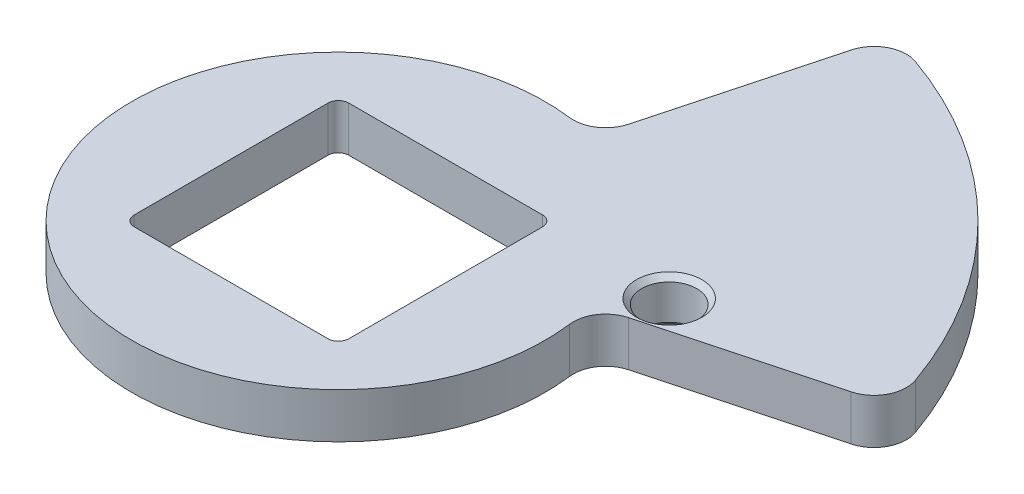
ISO-10303-21;
HEADER;
FILE_DESCRIPTION(('STEP AP214'),'2;1');
FILE_NAME('part.step','',(''),(''),'','','');
FILE_SCHEMA(('AUTOMOTIVE_DESIGN { 1 0 10303 214 1 1 1 1 }'));
ENDSEC;
DATA;
#1=APPLICATION_CONTEXT('core data for automotive mechanical design processes');
#2=APPLICATION_PROTOCOL_DEFINITION('international standard','automotive_design',2000,#1);
#3=PRODUCT_CONTEXT('',#1,'mechanical');
#4=PRODUCT('Part','Part','',(#3));
#5=PRODUCT_RELATED_PRODUCT_CATEGORY('part','',(#4));
#6=PRODUCT_DEFINITION_FORMATION('','',#4);
#7=PRODUCT_DEFINITION_CONTEXT('part definition',#1,'design');
#8=PRODUCT_DEFINITION('design','',#6,#7);
#9=PRODUCT_DEFINITION_SHAPE('','',#8);
#10=(LENGTH_UNIT() NAMED_UNIT(*) SI_UNIT(.MILLI.,.METRE.));
#11=(NAMED_UNIT(*) PLANE_ANGLE_UNIT() SI_UNIT($,.RADIAN.));
#12=(NAMED_UNIT(*) SI_UNIT($,.STERADIAN.) SOLID_ANGLE_UNIT());
#13=UNCERTAINTY_MEASURE_WITH_UNIT(LENGTH_MEASURE(1.E-05),#10,'distance_accuracy_value','');
#14=(GEOMETRIC_REPRESENTATION_CONTEXT(3) GLOBAL_UNCERTAINTY_ASSIGNED_CONTEXT((#13)) GLOBAL_UNIT_ASSIGNED_CONTEXT((#10,
#11,#12)) REPRESENTATION_CONTEXT('',''));
#15=CARTESIAN_POINT('',(0.,0.,0.));
#16=DIRECTION('',(0.,0.,1.));
#17=DIRECTION('',(1.,0.,0.));
#18=AXIS2_PLACEMENT_3D('',#15,#16,#17);
#19=CARTESIAN_POINT('',(0.,4.445,0.));
#20=DIRECTION('',(0.,-1.,0.));
#21=DIRECTION('',(0.,0.,-1.));
#22=AXIS2_PLACEMENT_3D('',#19,#20,#21);
#23=PLANE('',#22);
#24=CARTESIAN_POINT('',(22.86,4.445,-9.652));
#25=DIRECTION('',(0.,-1.,0.));
#26=DIRECTION('',(0.,0.,-1.));
#27=AXIS2_PLACEMENT_3D('',#24,#25,#26);
#28=CIRCLE('',#27,3.2147682252659);
#29=CARTESIAN_POINT('',(22.86,4.445,-12.8667682252659));
#30=VERTEX_POINT('',#29);
#31=EDGE_CURVE('E11',#30,#30,#28,.T.);
#32=ORIENTED_EDGE('',*,*,#31,.T.);
#33=EDGE_LOOP('',(#32));
#34=FACE_BOUND('',#33,.T.);
#35=CARTESIAN_POINT('',(0.,4.445,0.));
#36=DIRECTION('',(0.,1.,0.));
#37=DIRECTION('',(0.,0.,-1.));
#38=AXIS2_PLACEMENT_3D('',#35,#36,#37);
#39=CIRCLE('',#38,44.45);
#40=CARTESIAN_POINT('',(41.9232246474188,4.445,-14.773142359094));
#41=VERTEX_POINT('',#40);
#42=CARTESIAN_POINT('',(14.7731423590938,4.445,-41.9232246474188));
#43=VERTEX_POINT('',#42);
#44=EDGE_CURVE('E179',#41,#43,#39,.T.);
#45=ORIENTED_EDGE('',*,*,#44,.T.);
#46=CARTESIAN_POINT('',(13.7179179048728,4.445,-38.9287086011746));
#47=DIRECTION('',(0.,-1.,0.));
#48=DIRECTION('',(0.,0.,-1.));
#49=AXIS2_PLACEMENT_3D('',#46,#47,#48);
#50=CIRCLE('',#49,3.175);
#51=CARTESIAN_POINT('',(10.651103406405,4.445,-39.7504590693751));
#52=VERTEX_POINT('',#51);
#53=EDGE_CURVE('E201',#43,#52,#50,.F.);
#54=ORIENTED_EDGE('',*,*,#53,.T.);
#55=DIRECTION('',(-0.258819045102511,0.,0.965925826289071));
#56=VECTOR('',#55,1.);
#57=CARTESIAN_POINT('',(11.5045065548066,4.445,-42.9354029785492));
#58=LINE('',#57,#56);
#59=CARTESIAN_POINT('',(6.02517395663052,4.445,-22.4862553305868));
#60=VERTEX_POINT('',#59);
#61=EDGE_CURVE('E284',#52,#60,#58,.T.);
#62=ORIENTED_EDGE('',*,*,#61,.T.);
#63=CARTESIAN_POINT('',(2.95835945816272,4.445,-23.3080057987872));
#64=DIRECTION('',(0.,-1.,0.));
#65=DIRECTION('',(0.,0.,-1.));
#66=AXIS2_PLACEMENT_3D('',#63,#64,#65);
#67=CIRCLE('',#66,3.175);
#68=CARTESIAN_POINT('',(2.55858115300559,4.445,-20.1582752854376));
#69=VERTEX_POINT('',#68);
#70=EDGE_CURVE('E158',#60,#69,#67,.T.);
#71=ORIENTED_EDGE('',*,*,#70,.T.);
#72=CARTESIAN_POINT('',(0.,4.445,0.));
#73=DIRECTION('',(0.,1.,0.));
#74=DIRECTION('',(0.,0.,1.));
#75=AXIS2_PLACEMENT_3D('',#72,#73,#74);
#76=CIRCLE('',#75,20.32);
#77=CARTESIAN_POINT('',(20.1582752854376,4.445,-2.55858115300567));
#78=VERTEX_POINT('',#77);
#79=EDGE_CURVE('E168',#69,#78,#76,.T.);
#80=ORIENTED_EDGE('',*,*,#79,.T.);
#81=CARTESIAN_POINT('',(23.3080057987872,4.445,-2.95835945816281));
#82=DIRECTION('',(0.,-1.,0.));
#83=DIRECTION('',(0.,0.,-1.));
#84=AXIS2_PLACEMENT_3D('',#81,#82,#83);
#85=CIRCLE('',#84,3.175);
#86=CARTESIAN_POINT('',(22.4862553305867,4.445,-6.02517395663061));
#87=VERTEX_POINT('',#86);
#88=EDGE_CURVE('E209',#78,#87,#85,.T.);
#89=ORIENTED_EDGE('',*,*,#88,.T.);
#90=DIRECTION('',(0.96592582628907,0.,-0.258819045102515));
#91=VECTOR('',#90,1.);
#92=CARTESIAN_POINT('',(42.9354029785491,4.445,-11.5045065548068));
#93=LINE('',#92,#91);
#94=CARTESIAN_POINT('',(39.7504590693751,4.445,-10.6511034064052));
#95=VERTEX_POINT('',#94);
#96=EDGE_CURVE('E185',#87,#95,#93,.T.);
#97=ORIENTED_EDGE('',*,*,#96,.T.);
#98=CARTESIAN_POINT('',(38.9287086011746,4.445,-13.717917904873));
#99=DIRECTION('',(0.,-1.,0.));
#100=DIRECTION('',(0.,0.,-1.));
#101=AXIS2_PLACEMENT_3D('',#98,#99,#100);
#102=CIRCLE('',#101,3.175);
#103=EDGE_CURVE('E199',#95,#41,#102,.F.);
#104=ORIENTED_EDGE('',*,*,#103,.T.);
#105=EDGE_LOOP('',(#45,#54,#62,#71,#80,#89,#97,#104));
#106=FACE_BOUND('',#105,.T.);
#107=DIRECTION('',(0.,0.,-1.));
#108=VECTOR('',#107,1.);
#109=CARTESIAN_POINT('',(10.541,4.445,-10.541));
#110=LINE('',#109,#108);
#111=CARTESIAN_POINT('',(10.541,4.445,9.525));
#112=VERTEX_POINT('',#111);
#113=CARTESIAN_POINT('',(10.541,4.445,-9.525));
#114=VERTEX_POINT('',#113);
#115=EDGE_CURVE('E276',#112,#114,#110,.T.);
#116=ORIENTED_EDGE('',*,*,#115,.F.);
#117=CARTESIAN_POINT('',(9.525,4.445,9.525));
#118=DIRECTION('',(0.,-1.,0.));
#119=DIRECTION('',(0.,0.,-1.));
#120=AXIS2_PLACEMENT_3D('',#117,#118,#119);
#121=CIRCLE('',#120,1.016);
#122=CARTESIAN_POINT('',(9.525,4.445,10.541));
#123=VERTEX_POINT('',#122);
#124=EDGE_CURVE('E48',#112,#123,#121,.T.);
#125=ORIENTED_EDGE('',*,*,#124,.T.);
#126=DIRECTION('',(1.,0.,0.));
#127=VECTOR('',#126,1.);
#128=CARTESIAN_POINT('',(-10.541,4.445,10.541));
#129=LINE('',#128,#127);
#130=CARTESIAN_POINT('',(-9.525,4.445,10.541));
#131=VERTEX_POINT('',#130);
#132=EDGE_CURVE('E290',#131,#123,#129,.T.);
#133=ORIENTED_EDGE('',*,*,#132,.F.);
#134=CARTESIAN_POINT('',(-9.525,4.445,9.525));
#135=DIRECTION('',(0.,-1.,0.));
#136=DIRECTION('',(0.,0.,-1.));
#137=AXIS2_PLACEMENT_3D('',#134,#135,#136);
#138=CIRCLE('',#137,1.016);
#139=CARTESIAN_POINT('',(-10.541,4.445,9.525));
#140=VERTEX_POINT('',#139);
#141=EDGE_CURVE('E243',#131,#140,#138,.T.);
#142=ORIENTED_EDGE('',*,*,#141,.T.);
#143=DIRECTION('',(0.,0.,1.));
#144=VECTOR('',#143,1.);
#145=CARTESIAN_POINT('',(-10.541,4.445,-10.541));
#146=LINE('',#145,#144);
#147=CARTESIAN_POINT('',(-10.541,4.445,-9.525));
#148=VERTEX_POINT('',#147);
#149=EDGE_CURVE('E294',#148,#140,#146,.T.);
#150=ORIENTED_EDGE('',*,*,#149,.F.);
#151=CARTESIAN_POINT('',(-9.525,4.445,-9.525));
#152=DIRECTION('',(0.,-1.,0.));
#153=DIRECTION('',(0.,0.,-1.));
#154=AXIS2_PLACEMENT_3D('',#151,#152,#153);
#155=CIRCLE('',#154,1.016);
#156=CARTESIAN_POINT('',(-9.525,4.445,-10.541));
#157=VERTEX_POINT('',#156);
#158=EDGE_CURVE('E236',#148,#157,#155,.T.);
#159=ORIENTED_EDGE('',*,*,#158,.T.);
#160=DIRECTION('',(-1.,0.,0.));
#161=VECTOR('',#160,1.);
#162=CARTESIAN_POINT('',(-10.541,4.445,-10.541));
#163=LINE('',#162,#161);
#164=CARTESIAN_POINT('',(9.525,4.445,-10.541));
#165=VERTEX_POINT('',#164);
#166=EDGE_CURVE('E298',#165,#157,#163,.T.);
#167=ORIENTED_EDGE('',*,*,#166,.F.);
#168=CARTESIAN_POINT('',(9.525,4.445,-9.525));
#169=DIRECTION('',(0.,-1.,0.));
#170=DIRECTION('',(0.,0.,-1.));
#171=AXIS2_PLACEMENT_3D('',#168,#169,#170);
#172=CIRCLE('',#171,1.016);
#173=EDGE_CURVE('E232',#165,#114,#172,.T.);
#174=ORIENTED_EDGE('',*,*,#173,.T.);
#175=EDGE_LOOP('',(#116,#125,#133,#142,#150,#159,#167,#174));
#176=FACE_BOUND('',#175,.T.);
#177=ADVANCED_FACE('F33',(#34,#106,#176),#23,.F.);
#178=CARTESIAN_POINT('',(0.,0.,0.));
#179=DIRECTION('',(0.,-1.,0.));
#180=DIRECTION('',(0.,0.,-1.));
#181=AXIS2_PLACEMENT_3D('',#178,#179,#180);
#182=PLANE('',#181);
#183=CARTESIAN_POINT('',(22.86,0.,-9.652));
#184=DIRECTION('',(0.,-1.,0.));
#185=DIRECTION('',(0.,0.,-1.));
#186=AXIS2_PLACEMENT_3D('',#183,#184,#185);
#187=CIRCLE('',#186,3.2147682252659);
#188=CARTESIAN_POINT('',(22.86,0.,-12.8667682252659));
#189=VERTEX_POINT('',#188);
#190=EDGE_CURVE('E245',#189,#189,#187,.F.);
#191=ORIENTED_EDGE('',*,*,#190,.T.);
#192=EDGE_LOOP('',(#191));
#193=FACE_BOUND('',#192,.T.);
#194=DIRECTION('',(0.,0.,1.));
#195=VECTOR('',#194,1.);
#196=CARTESIAN_POINT('',(-10.541,0.,-10.541));
#197=LINE('',#196,#195);
#198=CARTESIAN_POINT('',(-10.541,0.,-9.525));
#199=VERTEX_POINT('',#198);
#200=CARTESIAN_POINT('',(-10.541,0.,9.525));
#201=VERTEX_POINT('',#200);
#202=EDGE_CURVE('E268',#199,#201,#197,.T.);
#203=ORIENTED_EDGE('',*,*,#202,.T.);
#204=CARTESIAN_POINT('',(-9.525,0.,9.525));
#205=DIRECTION('',(0.,-1.,0.));
#206=DIRECTION('',(0.,0.,-1.));
#207=AXIS2_PLACEMENT_3D('',#204,#205,#206);
#208=CIRCLE('',#207,1.016);
#209=CARTESIAN_POINT('',(-9.525,0.,10.541));
#210=VERTEX_POINT('',#209);
#211=EDGE_CURVE('E241',#201,#210,#208,.F.);
#212=ORIENTED_EDGE('',*,*,#211,.T.);
#213=DIRECTION('',(1.,0.,0.));
#214=VECTOR('',#213,1.);
#215=CARTESIAN_POINT('',(-10.541,0.,10.541));
#216=LINE('',#215,#214);
#217=CARTESIAN_POINT('',(9.525,0.,10.541));
#218=VERTEX_POINT('',#217);
#219=EDGE_CURVE('E273',#210,#218,#216,.T.);
#220=ORIENTED_EDGE('',*,*,#219,.T.);
#221=CARTESIAN_POINT('',(9.525,0.,9.525));
#222=DIRECTION('',(0.,-1.,0.));
#223=DIRECTION('',(0.,0.,-1.));
#224=AXIS2_PLACEMENT_3D('',#221,#222,#223);
#225=CIRCLE('',#224,1.016);
#226=CARTESIAN_POINT('',(10.541,0.,9.525));
#227=VERTEX_POINT('',#226);
#228=EDGE_CURVE('E238',#218,#227,#225,.F.);
#229=ORIENTED_EDGE('',*,*,#228,.T.);
#230=DIRECTION('',(0.,0.,-1.));
#231=VECTOR('',#230,1.);
#232=CARTESIAN_POINT('',(10.541,0.,-10.541));
#233=LINE('',#232,#231);
#234=CARTESIAN_POINT('',(10.541,0.,-9.525));
#235=VERTEX_POINT('',#234);
#236=EDGE_CURVE('E278',#227,#235,#233,.T.);
#237=ORIENTED_EDGE('',*,*,#236,.T.);
#238=CARTESIAN_POINT('',(9.525,0.,-9.525));
#239=DIRECTION('',(0.,-1.,0.));
#240=DIRECTION('',(0.,0.,-1.));
#241=AXIS2_PLACEMENT_3D('',#238,#239,#240);
#242=CIRCLE('',#241,1.016);
#243=CARTESIAN_POINT('',(9.525,0.,-10.541));
#244=VERTEX_POINT('',#243);
#245=EDGE_CURVE('E230',#235,#244,#242,.F.);
#246=ORIENTED_EDGE('',*,*,#245,.T.);
#247=DIRECTION('',(-1.,0.,0.));
#248=VECTOR('',#247,1.);
#249=CARTESIAN_POINT('',(-10.541,0.,-10.541));
#250=LINE('',#249,#248);
#251=CARTESIAN_POINT('',(-9.525,0.,-10.541));
#252=VERTEX_POINT('',#251);
#253=EDGE_CURVE('E274',#244,#252,#250,.T.);
#254=ORIENTED_EDGE('',*,*,#253,.T.);
#255=CARTESIAN_POINT('',(-9.525,0.,-9.525));
#256=DIRECTION('',(0.,-1.,0.));
#257=DIRECTION('',(0.,0.,-1.));
#258=AXIS2_PLACEMENT_3D('',#255,#256,#257);
#259=CIRCLE('',#258,1.016);
#260=EDGE_CURVE('E234',#252,#199,#259,.F.);
#261=ORIENTED_EDGE('',*,*,#260,.T.);
#262=EDGE_LOOP('',(#203,#212,#220,#229,#237,#246,#254,#261));
#263=FACE_BOUND('',#262,.T.);
#264=DIRECTION('',(-0.258819045102511,0.,0.965925826289071));
#265=VECTOR('',#264,1.);
#266=CARTESIAN_POINT('',(11.5045065548066,0.,-42.9354029785492));
#267=LINE('',#266,#265);
#268=CARTESIAN_POINT('',(10.651103406405,0.,-39.7504590693751));
#269=VERTEX_POINT('',#268);
#270=CARTESIAN_POINT('',(6.02517395663052,0.,-22.4862553305868));
#271=VERTEX_POINT('',#270);
#272=EDGE_CURVE('E176',#269,#271,#267,.T.);
#273=ORIENTED_EDGE('',*,*,#272,.F.);
#274=CARTESIAN_POINT('',(13.7179179048728,0.,-38.9287086011746));
#275=DIRECTION('',(0.,-1.,0.));
#276=DIRECTION('',(0.,0.,-1.));
#277=AXIS2_PLACEMENT_3D('',#274,#275,#276);
#278=CIRCLE('',#277,3.175);
#279=CARTESIAN_POINT('',(14.7731423590938,0.,-41.9232246474188));
#280=VERTEX_POINT('',#279);
#281=EDGE_CURVE('E192',#269,#280,#278,.T.);
#282=ORIENTED_EDGE('',*,*,#281,.T.);
#283=CARTESIAN_POINT('',(0.,0.,0.));
#284=DIRECTION('',(0.,1.,0.));
#285=DIRECTION('',(0.,0.,-1.));
#286=AXIS2_PLACEMENT_3D('',#283,#284,#285);
#287=CIRCLE('',#286,44.45);
#288=CARTESIAN_POINT('',(41.9232246474188,0.,-14.773142359094));
#289=VERTEX_POINT('',#288);
#290=EDGE_CURVE('E181',#289,#280,#287,.T.);
#291=ORIENTED_EDGE('',*,*,#290,.F.);
#292=CARTESIAN_POINT('',(38.9287086011746,0.,-13.717917904873));
#293=DIRECTION('',(0.,-1.,0.));
#294=DIRECTION('',(0.,0.,-1.));
#295=AXIS2_PLACEMENT_3D('',#292,#293,#294);
#296=CIRCLE('',#295,3.175);
#297=CARTESIAN_POINT('',(39.7504590693751,0.,-10.6511034064052));
#298=VERTEX_POINT('',#297);
#299=EDGE_CURVE('E190',#289,#298,#296,.T.);
#300=ORIENTED_EDGE('',*,*,#299,.T.);
#301=DIRECTION('',(0.96592582628907,0.,-0.258819045102515));
#302=VECTOR('',#301,1.);
#303=CARTESIAN_POINT('',(42.9354029785491,0.,-11.5045065548068));
#304=LINE('',#303,#302);
#305=CARTESIAN_POINT('',(22.4862553305867,0.,-6.02517395663061));
#306=VERTEX_POINT('',#305);
#307=EDGE_CURVE('E175',#306,#298,#304,.T.);
#308=ORIENTED_EDGE('',*,*,#307,.F.);
#309=CARTESIAN_POINT('',(23.3080057987872,0.,-2.95835945816281));
#310=DIRECTION('',(0.,-1.,0.));
#311=DIRECTION('',(0.,0.,-1.));
#312=AXIS2_PLACEMENT_3D('',#309,#310,#311);
#313=CIRCLE('',#312,3.175);
#314=CARTESIAN_POINT('',(20.1582752854376,0.,-2.55858115300567));
#315=VERTEX_POINT('',#314);
#316=EDGE_CURVE('E174',#306,#315,#313,.F.);
#317=ORIENTED_EDGE('',*,*,#316,.T.);
#318=CARTESIAN_POINT('',(0.,0.,0.));
#319=DIRECTION('',(0.,1.,0.));
#320=DIRECTION('',(0.,0.,1.));
#321=AXIS2_PLACEMENT_3D('',#318,#319,#320);
#322=CIRCLE('',#321,20.32);
#323=CARTESIAN_POINT('',(2.55858115300559,0.,-20.1582752854376));
#324=VERTEX_POINT('',#323);
#325=EDGE_CURVE('E165',#324,#315,#322,.T.);
#326=ORIENTED_EDGE('',*,*,#325,.F.);
#327=CARTESIAN_POINT('',(2.95835945816272,0.,-23.3080057987872));
#328=DIRECTION('',(0.,-1.,0.));
#329=DIRECTION('',(0.,0.,-1.));
#330=AXIS2_PLACEMENT_3D('',#327,#328,#329);
#331=CIRCLE('',#330,3.175);
#332=EDGE_CURVE('E148',#324,#271,#331,.F.);
#333=ORIENTED_EDGE('',*,*,#332,.T.);
#334=EDGE_LOOP('',(#273,#282,#291,#300,#308,#317,#326,#333));
#335=FACE_BOUND('',#334,.T.);
#336=ADVANCED_FACE('F172',(#193,#263,#335),#182,.T.);
#337=CARTESIAN_POINT('',(0.,4.445,0.));
#338=DIRECTION('',(0.,-1.,0.));
#339=DIRECTION('',(0.,0.,-1.));
#340=AXIS2_PLACEMENT_3D('',#337,#338,#339);
#341=CYLINDRICAL_SURFACE('',#340,44.45);
#342=ORIENTED_EDGE('',*,*,#290,.T.);
#343=DIRECTION('',(0.,-1.,0.));
#344=VECTOR('',#343,1.);
#345=CARTESIAN_POINT('',(14.7731423590938,4.445,-41.9232246474188));
#346=LINE('',#345,#344);
#347=EDGE_CURVE('E197',#280,#43,#346,.F.);
#348=ORIENTED_EDGE('',*,*,#347,.T.);
#349=ORIENTED_EDGE('',*,*,#44,.F.);
#350=DIRECTION('',(0.,-1.,0.));
#351=VECTOR('',#350,1.);
#352=CARTESIAN_POINT('',(41.9232246474188,4.445,-14.773142359094));
#353=LINE('',#352,#351);
#354=EDGE_CURVE('E194',#41,#289,#353,.T.);
#355=ORIENTED_EDGE('',*,*,#354,.T.);
#356=EDGE_LOOP('',(#342,#348,#349,#355));
#357=FACE_BOUND('',#356,.T.);
#358=ADVANCED_FACE('F264',(#357),#341,.T.);
#359=CARTESIAN_POINT('',(11.5045065548066,4.445,-42.9354029785492));
#360=DIRECTION('',(0.965925826289071,0.,0.258819045102511));
#361=DIRECTION('',(0.258819045102511,0.,-0.965925826289071));
#362=AXIS2_PLACEMENT_3D('',#359,#360,#361);
#363=PLANE('',#362);
#364=ORIENTED_EDGE('',*,*,#272,.T.);
#365=DIRECTION('',(0.,1.,0.));
#366=VECTOR('',#365,1.);
#367=CARTESIAN_POINT('',(6.02517395663052,4.445,-22.4862553305868));
#368=LINE('',#367,#366);
#369=EDGE_CURVE('E153',#271,#60,#368,.T.);
#370=ORIENTED_EDGE('',*,*,#369,.T.);
#371=ORIENTED_EDGE('',*,*,#61,.F.);
#372=DIRECTION('',(0.,-1.,0.));
#373=VECTOR('',#372,1.);
#374=CARTESIAN_POINT('',(10.651103406405,4.445,-39.7504590693751));
#375=LINE('',#374,#373);
#376=EDGE_CURVE('E169',#52,#269,#375,.T.);
#377=ORIENTED_EDGE('',*,*,#376,.T.);
#378=EDGE_LOOP('',(#364,#370,#371,#377));
#379=FACE_BOUND('',#378,.T.);
#380=ADVANCED_FACE('F356',(#379),#363,.F.);
#381=CARTESIAN_POINT('',(0.,4.445,0.));
#382=DIRECTION('',(0.,-1.,0.));
#383=DIRECTION('',(0.,0.,-1.));
#384=AXIS2_PLACEMENT_3D('',#381,#382,#383);
#385=CYLINDRICAL_SURFACE('',#384,20.32);
#386=ORIENTED_EDGE('',*,*,#79,.F.);
#387=DIRECTION('',(0.,-1.,0.));
#388=VECTOR('',#387,1.);
#389=CARTESIAN_POINT('',(2.55858115300559,4.445,-20.1582752854376));
#390=LINE('',#389,#388);
#391=EDGE_CURVE('E152',#69,#324,#390,.T.);
#392=ORIENTED_EDGE('',*,*,#391,.T.);
#393=ORIENTED_EDGE('',*,*,#325,.T.);
#394=DIRECTION('',(0.,-1.,0.));
#395=VECTOR('',#394,1.);
#396=CARTESIAN_POINT('',(20.1582752854376,4.445,-2.55858115300567));
#397=LINE('',#396,#395);
#398=EDGE_CURVE('E170',#315,#78,#397,.F.);
#399=ORIENTED_EDGE('',*,*,#398,.T.);
#400=EDGE_LOOP('',(#386,#392,#393,#399));
#401=FACE_BOUND('',#400,.T.);
#402=ADVANCED_FACE('F164',(#401),#385,.T.);
#403=CARTESIAN_POINT('',(42.9354029785491,4.445,-11.5045065548068));
#404=DIRECTION('',(-0.258819045102515,0.,-0.96592582628907));
#405=DIRECTION('',(-0.96592582628907,0.,0.258819045102515));
#406=AXIS2_PLACEMENT_3D('',#403,#404,#405);
#407=PLANE('',#406);
#408=ORIENTED_EDGE('',*,*,#307,.T.);
#409=DIRECTION('',(0.,-1.,0.));
#410=VECTOR('',#409,1.);
#411=CARTESIAN_POINT('',(39.7504590693751,4.445,-10.6511034064052));
#412=LINE('',#411,#410);
#413=EDGE_CURVE('E159',#298,#95,#412,.F.);
#414=ORIENTED_EDGE('',*,*,#413,.T.);
#415=ORIENTED_EDGE('',*,*,#96,.F.);
#416=DIRECTION('',(0.,1.,0.));
#417=VECTOR('',#416,1.);
#418=CARTESIAN_POINT('',(22.4862553305867,0.,-6.02517395663061));
#419=LINE('',#418,#417);
#420=EDGE_CURVE('E203',#87,#306,#419,.F.);
#421=ORIENTED_EDGE('',*,*,#420,.T.);
#422=EDGE_LOOP('',(#408,#414,#415,#421));
#423=FACE_BOUND('',#422,.T.);
#424=ADVANCED_FACE('F350',(#423),#407,.F.);
#425=CARTESIAN_POINT('',(10.541,4.445,-10.541));
#426=DIRECTION('',(-1.,0.,0.));
#427=DIRECTION('',(0.,0.,1.));
#428=AXIS2_PLACEMENT_3D('',#425,#426,#427);
#429=PLANE('',#428);
#430=ORIENTED_EDGE('',*,*,#115,.T.);
#431=DIRECTION('',(0.,-1.,0.));
#432=VECTOR('',#431,1.);
#433=CARTESIAN_POINT('',(10.541,0.,-9.525));
#434=LINE('',#433,#432);
#435=EDGE_CURVE('E213',#114,#235,#434,.T.);
#436=ORIENTED_EDGE('',*,*,#435,.T.);
#437=ORIENTED_EDGE('',*,*,#236,.F.);
#438=DIRECTION('',(0.,-1.,0.));
#439=VECTOR('',#438,1.);
#440=CARTESIAN_POINT('',(10.541,4.445,9.525));
#441=LINE('',#440,#439);
#442=EDGE_CURVE('E211',#227,#112,#441,.F.);
#443=ORIENTED_EDGE('',*,*,#442,.T.);
#444=EDGE_LOOP('',(#430,#436,#437,#443));
#445=FACE_BOUND('',#444,.T.);
#446=ADVANCED_FACE('F307',(#445),#429,.T.);
#447=CARTESIAN_POINT('',(-10.541,4.445,-10.541));
#448=DIRECTION('',(0.,0.,1.));
#449=DIRECTION('',(1.,0.,0.));
#450=AXIS2_PLACEMENT_3D('',#447,#448,#449);
#451=PLANE('',#450);
#452=ORIENTED_EDGE('',*,*,#253,.F.);
#453=DIRECTION('',(0.,-1.,0.));
#454=VECTOR('',#453,1.);
#455=CARTESIAN_POINT('',(9.525,4.445,-10.541));
#456=LINE('',#455,#454);
#457=EDGE_CURVE('E219',#244,#165,#456,.F.);
#458=ORIENTED_EDGE('',*,*,#457,.T.);
#459=ORIENTED_EDGE('',*,*,#166,.T.);
#460=DIRECTION('',(0.,-1.,0.));
#461=VECTOR('',#460,1.);
#462=CARTESIAN_POINT('',(-9.525,0.,-10.541));
#463=LINE('',#462,#461);
#464=EDGE_CURVE('E216',#157,#252,#463,.T.);
#465=ORIENTED_EDGE('',*,*,#464,.T.);
#466=EDGE_LOOP('',(#452,#458,#459,#465));
#467=FACE_BOUND('',#466,.T.);
#468=ADVANCED_FACE('F325',(#467),#451,.T.);
#469=CARTESIAN_POINT('',(-10.541,4.445,-10.541));
#470=DIRECTION('',(1.,0.,0.));
#471=DIRECTION('',(0.,0.,-1.));
#472=AXIS2_PLACEMENT_3D('',#469,#470,#471);
#473=PLANE('',#472);
#474=ORIENTED_EDGE('',*,*,#202,.F.);
#475=DIRECTION('',(0.,-1.,0.));
#476=VECTOR('',#475,1.);
#477=CARTESIAN_POINT('',(-10.541,4.445,-9.525));
#478=LINE('',#477,#476);
#479=EDGE_CURVE('E224',#199,#148,#478,.F.);
#480=ORIENTED_EDGE('',*,*,#479,.T.);
#481=ORIENTED_EDGE('',*,*,#149,.T.);
#482=DIRECTION('',(0.,-1.,0.));
#483=VECTOR('',#482,1.);
#484=CARTESIAN_POINT('',(-10.541,0.,9.525));
#485=LINE('',#484,#483);
#486=EDGE_CURVE('E221',#140,#201,#485,.T.);
#487=ORIENTED_EDGE('',*,*,#486,.T.);
#488=EDGE_LOOP('',(#474,#480,#481,#487));
#489=FACE_BOUND('',#488,.T.);
#490=ADVANCED_FACE('F317',(#489),#473,.T.);
#491=CARTESIAN_POINT('',(-10.541,4.445,10.541));
#492=DIRECTION('',(0.,0.,-1.));
#493=DIRECTION('',(-1.,0.,0.));
#494=AXIS2_PLACEMENT_3D('',#491,#492,#493);
#495=PLANE('',#494);
#496=ORIENTED_EDGE('',*,*,#132,.T.);
#497=DIRECTION('',(0.,-1.,0.));
#498=VECTOR('',#497,1.);
#499=CARTESIAN_POINT('',(9.525,0.,10.541));
#500=LINE('',#499,#498);
#501=EDGE_CURVE('E227',#123,#218,#500,.T.);
#502=ORIENTED_EDGE('',*,*,#501,.T.);
#503=ORIENTED_EDGE('',*,*,#219,.F.);
#504=DIRECTION('',(0.,-1.,0.));
#505=VECTOR('',#504,1.);
#506=CARTESIAN_POINT('',(-9.525,4.445,10.541));
#507=LINE('',#506,#505);
#508=EDGE_CURVE('E55',#210,#131,#507,.F.);
#509=ORIENTED_EDGE('',*,*,#508,.T.);
#510=EDGE_LOOP('',(#496,#502,#503,#509));
#511=FACE_BOUND('',#510,.T.);
#512=ADVANCED_FACE('F311',(#511),#495,.T.);
#513=CARTESIAN_POINT('',(22.86,4.445,-9.652));
#514=DIRECTION('',(0.,-1.,0.));
#515=DIRECTION('',(0.,0.,-1.));
#516=AXIS2_PLACEMENT_3D('',#513,#514,#515);
#517=CYLINDRICAL_SURFACE('',#516,2.7067682252659);
#518=CARTESIAN_POINT('',(22.86,0.508000000000002,-9.652));
#519=DIRECTION('',(0.,-1.,0.));
#520=DIRECTION('',(0.,0.,-1.));
#521=AXIS2_PLACEMENT_3D('',#518,#519,#520);
#522=CIRCLE('',#521,2.7067682252659);
#523=CARTESIAN_POINT('',(22.86,0.508000000000002,-12.3587682252659));
#524=VERTEX_POINT('',#523);
#525=EDGE_CURVE('E41',#524,#524,#522,.T.);
#526=ORIENTED_EDGE('',*,*,#525,.T.);
#527=EDGE_LOOP('',(#526));
#528=FACE_BOUND('',#527,.T.);
#529=CARTESIAN_POINT('',(22.86,3.93700000000001,-9.652));
#530=DIRECTION('',(0.,-1.,0.));
#531=DIRECTION('',(0.,0.,-1.));
#532=AXIS2_PLACEMENT_3D('',#529,#530,#531);
#533=CIRCLE('',#532,2.7067682252659);
#534=CARTESIAN_POINT('',(22.86,3.93700000000001,-12.3587682252659));
#535=VERTEX_POINT('',#534);
#536=EDGE_CURVE('E248',#535,#535,#533,.F.);
#537=ORIENTED_EDGE('',*,*,#536,.T.);
#538=EDGE_LOOP('',(#537));
#539=FACE_BOUND('',#538,.T.);
#540=ADVANCED_FACE('F253',(#528,#539),#517,.F.);
#541=CARTESIAN_POINT('',(2.95835945816272,4.445,-23.3080057987872));
#542=DIRECTION('',(0.,-1.,0.));
#543=DIRECTION('',(0.,0.,-1.));
#544=AXIS2_PLACEMENT_3D('',#541,#542,#543);
#545=CYLINDRICAL_SURFACE('',#544,3.175);
#546=ORIENTED_EDGE('',*,*,#70,.F.);
#547=ORIENTED_EDGE('',*,*,#369,.F.);
#548=ORIENTED_EDGE('',*,*,#332,.F.);
#549=ORIENTED_EDGE('',*,*,#391,.F.);
#550=EDGE_LOOP('',(#546,#547,#548,#549));
#551=FACE_BOUND('',#550,.T.);
#552=ADVANCED_FACE('F151',(#551),#545,.F.);
#553=CARTESIAN_POINT('',(13.7179179048728,4.445,-38.9287086011746));
#554=DIRECTION('',(0.,-1.,0.));
#555=DIRECTION('',(0.,0.,-1.));
#556=AXIS2_PLACEMENT_3D('',#553,#554,#555);
#557=CYLINDRICAL_SURFACE('',#556,3.175);
#558=ORIENTED_EDGE('',*,*,#53,.F.);
#559=ORIENTED_EDGE('',*,*,#347,.F.);
#560=ORIENTED_EDGE('',*,*,#281,.F.);
#561=ORIENTED_EDGE('',*,*,#376,.F.);
#562=EDGE_LOOP('',(#558,#559,#560,#561));
#563=FACE_BOUND('',#562,.T.);
#564=ADVANCED_FACE('F364',(#563),#557,.T.);
#565=CARTESIAN_POINT('',(38.9287086011746,4.445,-13.717917904873));
#566=DIRECTION('',(0.,-1.,0.));
#567=DIRECTION('',(0.,0.,-1.));
#568=AXIS2_PLACEMENT_3D('',#565,#566,#567);
#569=CYLINDRICAL_SURFACE('',#568,3.175);
#570=ORIENTED_EDGE('',*,*,#103,.F.);
#571=ORIENTED_EDGE('',*,*,#413,.F.);
#572=ORIENTED_EDGE('',*,*,#299,.F.);
#573=ORIENTED_EDGE('',*,*,#354,.F.);
#574=EDGE_LOOP('',(#570,#571,#572,#573));
#575=FACE_BOUND('',#574,.T.);
#576=ADVANCED_FACE('F338',(#575),#569,.T.);
#577=CARTESIAN_POINT('',(23.3080057987872,4.445,-2.95835945816281));
#578=DIRECTION('',(0.,-1.,0.));
#579=DIRECTION('',(0.,0.,-1.));
#580=AXIS2_PLACEMENT_3D('',#577,#578,#579);
#581=CYLINDRICAL_SURFACE('',#580,3.175);
#582=ORIENTED_EDGE('',*,*,#88,.F.);
#583=ORIENTED_EDGE('',*,*,#398,.F.);
#584=ORIENTED_EDGE('',*,*,#316,.F.);
#585=ORIENTED_EDGE('',*,*,#420,.F.);
#586=EDGE_LOOP('',(#582,#583,#584,#585));
#587=FACE_BOUND('',#586,.T.);
#588=ADVANCED_FACE('F331',(#587),#581,.F.);
#589=CARTESIAN_POINT('',(9.525,4.445,-9.525));
#590=DIRECTION('',(0.,1.,0.));
#591=DIRECTION('',(0.,0.,1.));
#592=AXIS2_PLACEMENT_3D('',#589,#590,#591);
#593=CYLINDRICAL_SURFACE('',#592,1.016);
#594=ORIENTED_EDGE('',*,*,#173,.F.);
#595=ORIENTED_EDGE('',*,*,#457,.F.);
#596=ORIENTED_EDGE('',*,*,#245,.F.);
#597=ORIENTED_EDGE('',*,*,#435,.F.);
#598=EDGE_LOOP('',(#594,#595,#596,#597));
#599=FACE_BOUND('',#598,.T.);
#600=ADVANCED_FACE('F329',(#599),#593,.F.);
#601=CARTESIAN_POINT('',(-9.525,4.445,-9.525));
#602=DIRECTION('',(0.,1.,0.));
#603=DIRECTION('',(0.,0.,1.));
#604=AXIS2_PLACEMENT_3D('',#601,#602,#603);
#605=CYLINDRICAL_SURFACE('',#604,1.016);
#606=ORIENTED_EDGE('',*,*,#158,.F.);
#607=ORIENTED_EDGE('',*,*,#479,.F.);
#608=ORIENTED_EDGE('',*,*,#260,.F.);
#609=ORIENTED_EDGE('',*,*,#464,.F.);
#610=EDGE_LOOP('',(#606,#607,#608,#609));
#611=FACE_BOUND('',#610,.T.);
#612=ADVANCED_FACE('F319',(#611),#605,.F.);
#613=CARTESIAN_POINT('',(9.525,4.445,9.525));
#614=DIRECTION('',(0.,1.,0.));
#615=DIRECTION('',(0.,0.,1.));
#616=AXIS2_PLACEMENT_3D('',#613,#614,#615);
#617=CYLINDRICAL_SURFACE('',#616,1.016);
#618=ORIENTED_EDGE('',*,*,#124,.F.);
#619=ORIENTED_EDGE('',*,*,#442,.F.);
#620=ORIENTED_EDGE('',*,*,#228,.F.);
#621=ORIENTED_EDGE('',*,*,#501,.F.);
#622=EDGE_LOOP('',(#618,#619,#620,#621));
#623=FACE_BOUND('',#622,.T.);
#624=ADVANCED_FACE('F310',(#623),#617,.F.);
#625=CARTESIAN_POINT('',(-9.525,4.445,9.525));
#626=DIRECTION('',(0.,1.,0.));
#627=DIRECTION('',(0.,0.,1.));
#628=AXIS2_PLACEMENT_3D('',#625,#626,#627);
#629=CYLINDRICAL_SURFACE('',#628,1.016);
#630=ORIENTED_EDGE('',*,*,#141,.F.);
#631=ORIENTED_EDGE('',*,*,#508,.F.);
#632=ORIENTED_EDGE('',*,*,#211,.F.);
#633=ORIENTED_EDGE('',*,*,#486,.F.);
#634=EDGE_LOOP('',(#630,#631,#632,#633));
#635=FACE_BOUND('',#634,.T.);
#636=ADVANCED_FACE('F259',(#635),#629,.F.);
#637=CARTESIAN_POINT('',(22.86,0.,-9.652));
#638=DIRECTION('',(0.,-1.,0.));
#639=DIRECTION('',(0.,0.,-1.));
#640=AXIS2_PLACEMENT_3D('',#637,#638,#639);
#641=CONICAL_SURFACE('',#640,3.2147682252659,0.785398163397446);
#642=ORIENTED_EDGE('',*,*,#525,.F.);
#643=EDGE_LOOP('',(#642));
#644=FACE_BOUND('',#643,.T.);
#645=ORIENTED_EDGE('',*,*,#190,.F.);
#646=EDGE_LOOP('',(#645));
#647=FACE_BOUND('',#646,.T.);
#648=ADVANCED_FACE('F256',(#644,#647),#641,.F.);
#649=CARTESIAN_POINT('',(22.86,3.93700000000001,-9.652));
#650=DIRECTION('',(0.,1.,0.));
#651=DIRECTION('',(0.,0.,1.));
#652=AXIS2_PLACEMENT_3D('',#649,#650,#651);
#653=CONICAL_SURFACE('',#652,2.7067682252659,0.785398163397454);
#654=ORIENTED_EDGE('',*,*,#31,.F.);
#655=EDGE_LOOP('',(#654));
#656=FACE_BOUND('',#655,.T.);
#657=ORIENTED_EDGE('',*,*,#536,.F.);
#658=EDGE_LOOP('',(#657));
#659=FACE_BOUND('',#658,.T.);
#660=ADVANCED_FACE('F35',(#656,#659),#653,.F.);
#661=CLOSED_SHELL('',(#177,#336,#358,#380,#402,#424,#446,#468,#490,#512,#540,#552,#564,#576,
#588,#600,#612,#624,#636,#648,#660));
#662=MANIFOLD_SOLID_BREP('B2',#661);
#663=ADVANCED_BREP_SHAPE_REPRESENTATION('',(#18,#662),#14);
#664=SHAPE_DEFINITION_REPRESENTATION(#9,#663);
ENDSEC;
END-ISO-10303-21;
